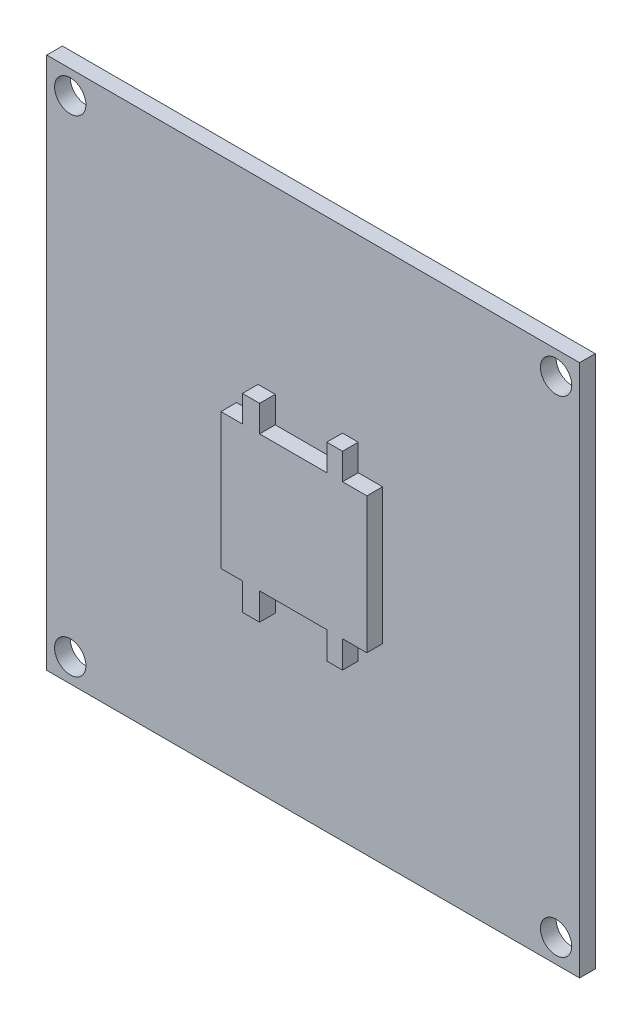
ISO-10303-21;
HEADER;
FILE_DESCRIPTION(('STEP AP214'),'2;1');
FILE_NAME('part.step','',(''),(''),'','','');
FILE_SCHEMA(('AUTOMOTIVE_DESIGN { 1 0 10303 214 1 1 1 1 }'));
ENDSEC;
DATA;
#1=APPLICATION_CONTEXT('core data for automotive mechanical design processes');
#2=APPLICATION_PROTOCOL_DEFINITION('international standard','automotive_design',2000,#1);
#3=PRODUCT_CONTEXT('',#1,'mechanical');
#4=PRODUCT('Part','Part','',(#3));
#5=PRODUCT_RELATED_PRODUCT_CATEGORY('part','',(#4));
#6=PRODUCT_DEFINITION_FORMATION('','',#4);
#7=PRODUCT_DEFINITION_CONTEXT('part definition',#1,'design');
#8=PRODUCT_DEFINITION('design','',#6,#7);
#9=PRODUCT_DEFINITION_SHAPE('','',#8);
#10=(LENGTH_UNIT() NAMED_UNIT(*) SI_UNIT(.MILLI.,.METRE.));
#11=(NAMED_UNIT(*) PLANE_ANGLE_UNIT() SI_UNIT($,.RADIAN.));
#12=(NAMED_UNIT(*) SI_UNIT($,.STERADIAN.) SOLID_ANGLE_UNIT());
#13=UNCERTAINTY_MEASURE_WITH_UNIT(LENGTH_MEASURE(1.E-05),#10,'distance_accuracy_value','');
#14=(GEOMETRIC_REPRESENTATION_CONTEXT(3) GLOBAL_UNCERTAINTY_ASSIGNED_CONTEXT((#13)) GLOBAL_UNIT_ASSIGNED_CONTEXT((#10,
#11,#12)) REPRESENTATION_CONTEXT('',''));
#15=CARTESIAN_POINT('',(0.,0.,0.));
#16=DIRECTION('',(0.,0.,1.));
#17=DIRECTION('',(1.,0.,0.));
#18=AXIS2_PLACEMENT_3D('',#15,#16,#17);
#19=CARTESIAN_POINT('',(0.,0.,1.));
#20=DIRECTION('',(0.,0.,-1.));
#21=DIRECTION('',(-1.,0.,0.));
#22=AXIS2_PLACEMENT_3D('',#19,#20,#21);
#23=PLANE('',#22);
#24=CARTESIAN_POINT('',(32.5,1.5,1.));
#25=DIRECTION('',(0.,0.,1.));
#26=DIRECTION('',(1.,0.,0.));
#27=AXIS2_PLACEMENT_3D('',#24,#25,#26);
#28=CIRCLE('',#27,0.999999999999998);
#29=CARTESIAN_POINT('',(33.5,1.5,1.));
#30=VERTEX_POINT('',#29);
#31=EDGE_CURVE('E237',#30,#30,#28,.T.);
#32=ORIENTED_EDGE('',*,*,#31,.F.);
#33=EDGE_LOOP('',(#32));
#34=FACE_BOUND('',#33,.T.);
#35=CARTESIAN_POINT('',(1.5,1.5,1.));
#36=DIRECTION('',(0.,0.,1.));
#37=DIRECTION('',(1.,0.,0.));
#38=AXIS2_PLACEMENT_3D('',#35,#36,#37);
#39=CIRCLE('',#38,1.);
#40=CARTESIAN_POINT('',(2.5,1.5,1.));
#41=VERTEX_POINT('',#40);
#42=EDGE_CURVE('E246',#41,#41,#39,.T.);
#43=ORIENTED_EDGE('',*,*,#42,.F.);
#44=EDGE_LOOP('',(#43));
#45=FACE_BOUND('',#44,.T.);
#46=CARTESIAN_POINT('',(32.5,32.5,1.));
#47=DIRECTION('',(0.,0.,1.));
#48=DIRECTION('',(1.,0.,0.));
#49=AXIS2_PLACEMENT_3D('',#46,#47,#48);
#50=CIRCLE('',#49,0.999999999999998);
#51=CARTESIAN_POINT('',(33.5,32.5,1.));
#52=VERTEX_POINT('',#51);
#53=EDGE_CURVE('E252',#52,#52,#50,.T.);
#54=ORIENTED_EDGE('',*,*,#53,.F.);
#55=EDGE_LOOP('',(#54));
#56=FACE_BOUND('',#55,.T.);
#57=CARTESIAN_POINT('',(1.5,32.5,1.));
#58=DIRECTION('',(0.,0.,1.));
#59=DIRECTION('',(1.,0.,0.));
#60=AXIS2_PLACEMENT_3D('',#57,#58,#59);
#61=CIRCLE('',#60,1.);
#62=CARTESIAN_POINT('',(2.5,32.5,1.));
#63=VERTEX_POINT('',#62);
#64=EDGE_CURVE('E258',#63,#63,#61,.T.);
#65=ORIENTED_EDGE('',*,*,#64,.F.);
#66=EDGE_LOOP('',(#65));
#67=FACE_BOUND('',#66,.T.);
#68=DIRECTION('',(0.,-1.,0.));
#69=VECTOR('',#68,1.);
#70=CARTESIAN_POINT('',(0.,0.,1.));
#71=LINE('',#70,#69);
#72=CARTESIAN_POINT('',(0.,34.,1.));
#73=VERTEX_POINT('',#72);
#74=CARTESIAN_POINT('',(0.,0.,1.));
#75=VERTEX_POINT('',#74);
#76=EDGE_CURVE('E264',#73,#75,#71,.T.);
#77=ORIENTED_EDGE('',*,*,#76,.T.);
#78=DIRECTION('',(1.,0.,0.));
#79=VECTOR('',#78,1.);
#80=CARTESIAN_POINT('',(0.,0.,1.));
#81=LINE('',#80,#79);
#82=CARTESIAN_POINT('',(34.,0.,1.));
#83=VERTEX_POINT('',#82);
#84=EDGE_CURVE('E88',#75,#83,#81,.T.);
#85=ORIENTED_EDGE('',*,*,#84,.T.);
#86=DIRECTION('',(0.,1.,0.));
#87=VECTOR('',#86,1.);
#88=CARTESIAN_POINT('',(34.,0.,1.));
#89=LINE('',#88,#87);
#90=CARTESIAN_POINT('',(34.,34.,1.));
#91=VERTEX_POINT('',#90);
#92=EDGE_CURVE('E267',#83,#91,#89,.T.);
#93=ORIENTED_EDGE('',*,*,#92,.T.);
#94=DIRECTION('',(-1.,0.,0.));
#95=VECTOR('',#94,1.);
#96=CARTESIAN_POINT('',(0.,34.,1.));
#97=LINE('',#96,#95);
#98=EDGE_CURVE('E60',#91,#73,#97,.T.);
#99=ORIENTED_EDGE('',*,*,#98,.T.);
#100=EDGE_LOOP('',(#77,#85,#93,#99));
#101=FACE_BOUND('',#100,.T.);
#102=DIRECTION('',(-1.,0.,0.));
#103=VECTOR('',#102,1.);
#104=CARTESIAN_POINT('',(0.,20.8566450376839,1.));
#105=LINE('',#104,#103);
#106=CARTESIAN_POINT('',(21.427154658643,20.8566450376839,1.));
#107=VERTEX_POINT('',#106);
#108=CARTESIAN_POINT('',(19.8753684896341,20.8566450376839,1.));
#109=VERTEX_POINT('',#108);
#110=EDGE_CURVE('E232',#107,#109,#105,.T.);
#111=ORIENTED_EDGE('',*,*,#110,.F.);
#112=DIRECTION('',(0.,-1.,0.));
#113=VECTOR('',#112,1.);
#114=CARTESIAN_POINT('',(21.427154658643,0.,1.));
#115=LINE('',#114,#113);
#116=CARTESIAN_POINT('',(21.427154658643,12.1848987991048,1.));
#117=VERTEX_POINT('',#116);
#118=EDGE_CURVE('E226',#107,#117,#115,.T.);
#119=ORIENTED_EDGE('',*,*,#118,.T.);
#120=DIRECTION('',(-1.,0.,0.));
#121=VECTOR('',#120,1.);
#122=CARTESIAN_POINT('',(0.,12.1848987991048,1.));
#123=LINE('',#122,#121);
#124=CARTESIAN_POINT('',(19.8753684896341,12.1848987991048,1.));
#125=VERTEX_POINT('',#124);
#126=EDGE_CURVE('E51',#117,#125,#123,.T.);
#127=ORIENTED_EDGE('',*,*,#126,.T.);
#128=DIRECTION('',(0.,-1.,0.));
#129=VECTOR('',#128,1.);
#130=CARTESIAN_POINT('',(19.8753684896341,0.,1.));
#131=LINE('',#130,#129);
#132=CARTESIAN_POINT('',(19.8753684896341,10.450549551389,1.));
#133=VERTEX_POINT('',#132);
#134=EDGE_CURVE('E684',#125,#133,#131,.T.);
#135=ORIENTED_EDGE('',*,*,#134,.T.);
#136=DIRECTION('',(1.,0.,0.));
#137=VECTOR('',#136,1.);
#138=CARTESIAN_POINT('',(0.,10.450549551389,1.));
#139=LINE('',#138,#137);
#140=CARTESIAN_POINT('',(18.871271556746,10.450549551389,1.));
#141=VERTEX_POINT('',#140);
#142=EDGE_CURVE('E681',#141,#133,#139,.T.);
#143=ORIENTED_EDGE('',*,*,#142,.F.);
#144=DIRECTION('',(0.,-1.,0.));
#145=VECTOR('',#144,1.);
#146=CARTESIAN_POINT('',(18.871271556746,0.,1.));
#147=LINE('',#146,#145);
#148=CARTESIAN_POINT('',(18.871271556746,12.1848987991048,1.));
#149=VERTEX_POINT('',#148);
#150=EDGE_CURVE('E679',#149,#141,#147,.T.);
#151=ORIENTED_EDGE('',*,*,#150,.F.);
#152=CARTESIAN_POINT('',(14.5810392071332,12.1848987991048,1.));
#153=VERTEX_POINT('',#152);
#154=EDGE_CURVE('E671',#149,#153,#123,.T.);
#155=ORIENTED_EDGE('',*,*,#154,.T.);
#156=DIRECTION('',(0.,-1.,0.));
#157=VECTOR('',#156,1.);
#158=CARTESIAN_POINT('',(14.5810392071332,0.,1.));
#159=LINE('',#158,#157);
#160=CARTESIAN_POINT('',(14.5810392071332,10.450549551389,1.));
#161=VERTEX_POINT('',#160);
#162=EDGE_CURVE('E676',#153,#161,#159,.T.);
#163=ORIENTED_EDGE('',*,*,#162,.T.);
#164=DIRECTION('',(1.,0.,0.));
#165=VECTOR('',#164,1.);
#166=CARTESIAN_POINT('',(0.,10.450549551389,1.));
#167=LINE('',#166,#165);
#168=CARTESIAN_POINT('',(13.4856607348916,10.450549551389,1.));
#169=VERTEX_POINT('',#168);
#170=EDGE_CURVE('E673',#169,#161,#167,.T.);
#171=ORIENTED_EDGE('',*,*,#170,.F.);
#172=DIRECTION('',(0.,-1.,0.));
#173=VECTOR('',#172,1.);
#174=CARTESIAN_POINT('',(13.4856607348916,0.,1.));
#175=LINE('',#174,#173);
#176=CARTESIAN_POINT('',(13.4856607348916,12.1848987991048,1.));
#177=VERTEX_POINT('',#176);
#178=EDGE_CURVE('E670',#177,#169,#175,.T.);
#179=ORIENTED_EDGE('',*,*,#178,.F.);
#180=CARTESIAN_POINT('',(12.1164376445897,12.1848987991048,1.));
#181=VERTEX_POINT('',#180);
#182=EDGE_CURVE('E667',#177,#181,#123,.T.);
#183=ORIENTED_EDGE('',*,*,#182,.T.);
#184=DIRECTION('',(0.,-1.,0.));
#185=VECTOR('',#184,1.);
#186=CARTESIAN_POINT('',(12.1164376445897,0.,1.));
#187=LINE('',#186,#185);
#188=CARTESIAN_POINT('',(12.1164376445897,20.8566450376839,1.));
#189=VERTEX_POINT('',#188);
#190=EDGE_CURVE('E664',#189,#181,#187,.T.);
#191=ORIENTED_EDGE('',*,*,#190,.F.);
#192=CARTESIAN_POINT('',(13.4856607348916,20.8566450376839,1.));
#193=VERTEX_POINT('',#192);
#194=EDGE_CURVE('E647',#193,#189,#105,.T.);
#195=ORIENTED_EDGE('',*,*,#194,.F.);
#196=DIRECTION('',(0.,1.,0.));
#197=VECTOR('',#196,1.);
#198=CARTESIAN_POINT('',(13.4856607348916,0.,1.));
#199=LINE('',#198,#197);
#200=CARTESIAN_POINT('',(13.4856607348916,22.5453535157229,1.));
#201=VERTEX_POINT('',#200);
#202=EDGE_CURVE('E658',#193,#201,#199,.T.);
#203=ORIENTED_EDGE('',*,*,#202,.T.);
#204=DIRECTION('',(1.,0.,0.));
#205=VECTOR('',#204,1.);
#206=CARTESIAN_POINT('',(0.,22.5453535157229,1.));
#207=LINE('',#206,#205);
#208=CARTESIAN_POINT('',(14.5810392071332,22.5453535157229,1.));
#209=VERTEX_POINT('',#208);
#210=EDGE_CURVE('E656',#201,#209,#207,.T.);
#211=ORIENTED_EDGE('',*,*,#210,.T.);
#212=DIRECTION('',(0.,1.,0.));
#213=VECTOR('',#212,1.);
#214=CARTESIAN_POINT('',(14.5810392071332,0.,1.));
#215=LINE('',#214,#213);
#216=CARTESIAN_POINT('',(14.5810392071332,20.8566450376839,1.));
#217=VERTEX_POINT('',#216);
#218=EDGE_CURVE('E644',#217,#209,#215,.T.);
#219=ORIENTED_EDGE('',*,*,#218,.F.);
#220=CARTESIAN_POINT('',(18.871271556746,20.8566450376839,1.));
#221=VERTEX_POINT('',#220);
#222=EDGE_CURVE('E634',#221,#217,#105,.T.);
#223=ORIENTED_EDGE('',*,*,#222,.F.);
#224=DIRECTION('',(0.,1.,0.));
#225=VECTOR('',#224,1.);
#226=CARTESIAN_POINT('',(18.871271556746,0.,1.));
#227=LINE('',#226,#225);
#228=CARTESIAN_POINT('',(18.871271556746,22.5453535157229,1.));
#229=VERTEX_POINT('',#228);
#230=EDGE_CURVE('E645',#221,#229,#227,.T.);
#231=ORIENTED_EDGE('',*,*,#230,.T.);
#232=DIRECTION('',(1.,0.,0.));
#233=VECTOR('',#232,1.);
#234=CARTESIAN_POINT('',(0.,22.5453535157229,1.));
#235=LINE('',#234,#233);
#236=CARTESIAN_POINT('',(19.8753684896341,22.5453535157229,1.));
#237=VERTEX_POINT('',#236);
#238=EDGE_CURVE('E726',#229,#237,#235,.T.);
#239=ORIENTED_EDGE('',*,*,#238,.T.);
#240=DIRECTION('',(0.,1.,0.));
#241=VECTOR('',#240,1.);
#242=CARTESIAN_POINT('',(19.8753684896341,0.,1.));
#243=LINE('',#242,#241);
#244=EDGE_CURVE('E727',#109,#237,#243,.T.);
#245=ORIENTED_EDGE('',*,*,#244,.F.);
#246=EDGE_LOOP('',(#111,#119,#127,#135,#143,#151,#155,#163,#171,#179,#183,#191,#195,#203,#211,
#219,#223,#231,#239,#245));
#247=FACE_BOUND('',#246,.T.);
#248=ADVANCED_FACE('F36',(#34,#45,#56,#67,#101,#247),#23,.F.);
#249=CARTESIAN_POINT('',(0.,0.,0.));
#250=DIRECTION('',(0.,0.,-1.));
#251=DIRECTION('',(-1.,0.,0.));
#252=AXIS2_PLACEMENT_3D('',#249,#250,#251);
#253=PLANE('',#252);
#254=CARTESIAN_POINT('',(1.5,1.5,0.));
#255=DIRECTION('',(0.,0.,1.));
#256=DIRECTION('',(1.,0.,0.));
#257=AXIS2_PLACEMENT_3D('',#254,#255,#256);
#258=CIRCLE('',#257,1.);
#259=CARTESIAN_POINT('',(2.5,1.5,0.));
#260=VERTEX_POINT('',#259);
#261=EDGE_CURVE('E244',#260,#260,#258,.T.);
#262=ORIENTED_EDGE('',*,*,#261,.T.);
#263=EDGE_LOOP('',(#262));
#264=FACE_BOUND('',#263,.T.);
#265=CARTESIAN_POINT('',(1.5,32.5,0.));
#266=DIRECTION('',(0.,0.,1.));
#267=DIRECTION('',(1.,0.,0.));
#268=AXIS2_PLACEMENT_3D('',#265,#266,#267);
#269=CIRCLE('',#268,1.);
#270=CARTESIAN_POINT('',(2.5,32.5,0.));
#271=VERTEX_POINT('',#270);
#272=EDGE_CURVE('E255',#271,#271,#269,.T.);
#273=ORIENTED_EDGE('',*,*,#272,.T.);
#274=EDGE_LOOP('',(#273));
#275=FACE_BOUND('',#274,.T.);
#276=DIRECTION('',(0.,-1.,0.));
#277=VECTOR('',#276,1.);
#278=CARTESIAN_POINT('',(0.,0.,0.));
#279=LINE('',#278,#277);
#280=CARTESIAN_POINT('',(0.,34.,0.));
#281=VERTEX_POINT('',#280);
#282=CARTESIAN_POINT('',(0.,0.,0.));
#283=VERTEX_POINT('',#282);
#284=EDGE_CURVE('E261',#281,#283,#279,.T.);
#285=ORIENTED_EDGE('',*,*,#284,.F.);
#286=DIRECTION('',(-1.,0.,0.));
#287=VECTOR('',#286,1.);
#288=CARTESIAN_POINT('',(0.,34.,0.));
#289=LINE('',#288,#287);
#290=CARTESIAN_POINT('',(34.,34.,0.));
#291=VERTEX_POINT('',#290);
#292=EDGE_CURVE('E81',#291,#281,#289,.T.);
#293=ORIENTED_EDGE('',*,*,#292,.F.);
#294=DIRECTION('',(0.,1.,0.));
#295=VECTOR('',#294,1.);
#296=CARTESIAN_POINT('',(34.,0.,0.));
#297=LINE('',#296,#295);
#298=CARTESIAN_POINT('',(34.,0.,0.));
#299=VERTEX_POINT('',#298);
#300=EDGE_CURVE('E275',#299,#291,#297,.T.);
#301=ORIENTED_EDGE('',*,*,#300,.F.);
#302=DIRECTION('',(1.,0.,0.));
#303=VECTOR('',#302,1.);
#304=CARTESIAN_POINT('',(0.,0.,0.));
#305=LINE('',#304,#303);
#306=EDGE_CURVE('E273',#283,#299,#305,.T.);
#307=ORIENTED_EDGE('',*,*,#306,.F.);
#308=EDGE_LOOP('',(#285,#293,#301,#307));
#309=FACE_BOUND('',#308,.T.);
#310=CARTESIAN_POINT('',(32.5,32.5,0.));
#311=DIRECTION('',(0.,0.,1.));
#312=DIRECTION('',(1.,0.,0.));
#313=AXIS2_PLACEMENT_3D('',#310,#311,#312);
#314=CIRCLE('',#313,0.999999999999998);
#315=CARTESIAN_POINT('',(33.5,32.5,0.));
#316=VERTEX_POINT('',#315);
#317=EDGE_CURVE('E249',#316,#316,#314,.T.);
#318=ORIENTED_EDGE('',*,*,#317,.T.);
#319=EDGE_LOOP('',(#318));
#320=FACE_BOUND('',#319,.T.);
#321=CARTESIAN_POINT('',(32.5,1.5,0.));
#322=DIRECTION('',(0.,0.,1.));
#323=DIRECTION('',(1.,0.,0.));
#324=AXIS2_PLACEMENT_3D('',#321,#322,#323);
#325=CIRCLE('',#324,0.999999999999998);
#326=CARTESIAN_POINT('',(33.5,1.5,0.));
#327=VERTEX_POINT('',#326);
#328=EDGE_CURVE('E234',#327,#327,#325,.T.);
#329=ORIENTED_EDGE('',*,*,#328,.T.);
#330=EDGE_LOOP('',(#329));
#331=FACE_BOUND('',#330,.T.);
#332=ADVANCED_FACE('F288',(#264,#275,#309,#320,#331),#253,.T.);
#333=CARTESIAN_POINT('',(0.,0.,1.));
#334=DIRECTION('',(1.,0.,0.));
#335=DIRECTION('',(0.,0.,-1.));
#336=AXIS2_PLACEMENT_3D('',#333,#334,#335);
#337=PLANE('',#336);
#338=ORIENTED_EDGE('',*,*,#284,.T.);
#339=DIRECTION('',(0.,0.,-1.));
#340=VECTOR('',#339,1.);
#341=CARTESIAN_POINT('',(0.,0.,1.));
#342=LINE('',#341,#340);
#343=EDGE_CURVE('E11',#75,#283,#342,.T.);
#344=ORIENTED_EDGE('',*,*,#343,.F.);
#345=ORIENTED_EDGE('',*,*,#76,.F.);
#346=DIRECTION('',(0.,0.,-1.));
#347=VECTOR('',#346,1.);
#348=CARTESIAN_POINT('',(0.,34.,1.));
#349=LINE('',#348,#347);
#350=EDGE_CURVE('E270',#73,#281,#349,.T.);
#351=ORIENTED_EDGE('',*,*,#350,.T.);
#352=EDGE_LOOP('',(#338,#344,#345,#351));
#353=FACE_BOUND('',#352,.T.);
#354=ADVANCED_FACE('F38',(#353),#337,.F.);
#355=CARTESIAN_POINT('',(0.,0.,1.));
#356=DIRECTION('',(0.,1.,0.));
#357=DIRECTION('',(0.,0.,1.));
#358=AXIS2_PLACEMENT_3D('',#355,#356,#357);
#359=PLANE('',#358);
#360=ORIENTED_EDGE('',*,*,#306,.T.);
#361=DIRECTION('',(0.,0.,-1.));
#362=VECTOR('',#361,1.);
#363=CARTESIAN_POINT('',(34.,0.,1.));
#364=LINE('',#363,#362);
#365=EDGE_CURVE('E44',#83,#299,#364,.T.);
#366=ORIENTED_EDGE('',*,*,#365,.F.);
#367=ORIENTED_EDGE('',*,*,#84,.F.);
#368=ORIENTED_EDGE('',*,*,#343,.T.);
#369=EDGE_LOOP('',(#360,#366,#367,#368));
#370=FACE_BOUND('',#369,.T.);
#371=ADVANCED_FACE('F304',(#370),#359,.F.);
#372=CARTESIAN_POINT('',(34.,0.,1.));
#373=DIRECTION('',(-1.,0.,0.));
#374=DIRECTION('',(0.,0.,1.));
#375=AXIS2_PLACEMENT_3D('',#372,#373,#374);
#376=PLANE('',#375);
#377=ORIENTED_EDGE('',*,*,#300,.T.);
#378=DIRECTION('',(0.,0.,-1.));
#379=VECTOR('',#378,1.);
#380=CARTESIAN_POINT('',(34.,34.,1.));
#381=LINE('',#380,#379);
#382=EDGE_CURVE('E279',#91,#291,#381,.T.);
#383=ORIENTED_EDGE('',*,*,#382,.F.);
#384=ORIENTED_EDGE('',*,*,#92,.F.);
#385=ORIENTED_EDGE('',*,*,#365,.T.);
#386=EDGE_LOOP('',(#377,#383,#384,#385));
#387=FACE_BOUND('',#386,.T.);
#388=ADVANCED_FACE('F284',(#387),#376,.F.);
#389=CARTESIAN_POINT('',(0.,34.,1.));
#390=DIRECTION('',(0.,-1.,0.));
#391=DIRECTION('',(0.,0.,-1.));
#392=AXIS2_PLACEMENT_3D('',#389,#390,#391);
#393=PLANE('',#392);
#394=ORIENTED_EDGE('',*,*,#292,.T.);
#395=ORIENTED_EDGE('',*,*,#350,.F.);
#396=ORIENTED_EDGE('',*,*,#98,.F.);
#397=ORIENTED_EDGE('',*,*,#382,.T.);
#398=EDGE_LOOP('',(#394,#395,#396,#397));
#399=FACE_BOUND('',#398,.T.);
#400=ADVANCED_FACE('F293',(#399),#393,.F.);
#401=CARTESIAN_POINT('',(1.5,32.5,1.));
#402=DIRECTION('',(0.,0.,-1.));
#403=DIRECTION('',(-1.,0.,0.));
#404=AXIS2_PLACEMENT_3D('',#401,#402,#403);
#405=CYLINDRICAL_SURFACE('',#404,1.);
#406=ORIENTED_EDGE('',*,*,#64,.T.);
#407=EDGE_LOOP('',(#406));
#408=FACE_BOUND('',#407,.T.);
#409=ORIENTED_EDGE('',*,*,#272,.F.);
#410=EDGE_LOOP('',(#409));
#411=FACE_BOUND('',#410,.T.);
#412=ADVANCED_FACE('F295',(#408,#411),#405,.F.);
#413=CARTESIAN_POINT('',(32.5,32.5,1.));
#414=DIRECTION('',(0.,0.,-1.));
#415=DIRECTION('',(-1.,0.,0.));
#416=AXIS2_PLACEMENT_3D('',#413,#414,#415);
#417=CYLINDRICAL_SURFACE('',#416,0.999999999999998);
#418=ORIENTED_EDGE('',*,*,#53,.T.);
#419=EDGE_LOOP('',(#418));
#420=FACE_BOUND('',#419,.T.);
#421=ORIENTED_EDGE('',*,*,#317,.F.);
#422=EDGE_LOOP('',(#421));
#423=FACE_BOUND('',#422,.T.);
#424=ADVANCED_FACE('F301',(#420,#423),#417,.F.);
#425=CARTESIAN_POINT('',(1.5,1.5,1.));
#426=DIRECTION('',(0.,0.,-1.));
#427=DIRECTION('',(-1.,0.,0.));
#428=AXIS2_PLACEMENT_3D('',#425,#426,#427);
#429=CYLINDRICAL_SURFACE('',#428,1.);
#430=ORIENTED_EDGE('',*,*,#42,.T.);
#431=EDGE_LOOP('',(#430));
#432=FACE_BOUND('',#431,.T.);
#433=ORIENTED_EDGE('',*,*,#261,.F.);
#434=EDGE_LOOP('',(#433));
#435=FACE_BOUND('',#434,.T.);
#436=ADVANCED_FACE('F319',(#432,#435),#429,.F.);
#437=CARTESIAN_POINT('',(32.5,1.5,1.));
#438=DIRECTION('',(0.,0.,-1.));
#439=DIRECTION('',(-1.,0.,0.));
#440=AXIS2_PLACEMENT_3D('',#437,#438,#439);
#441=CYLINDRICAL_SURFACE('',#440,0.999999999999998);
#442=ORIENTED_EDGE('',*,*,#31,.T.);
#443=EDGE_LOOP('',(#442));
#444=FACE_BOUND('',#443,.T.);
#445=ORIENTED_EDGE('',*,*,#328,.F.);
#446=EDGE_LOOP('',(#445));
#447=FACE_BOUND('',#446,.T.);
#448=ADVANCED_FACE('F323',(#444,#447),#441,.F.);
#449=CARTESIAN_POINT('',(0.,20.8566450376839,2.));
#450=DIRECTION('',(0.,-1.,0.));
#451=DIRECTION('',(0.,0.,-1.));
#452=AXIS2_PLACEMENT_3D('',#449,#450,#451);
#453=PLANE('',#452);
#454=ORIENTED_EDGE('',*,*,#110,.T.);
#455=DIRECTION('',(0.,0.,-1.));
#456=VECTOR('',#455,1.);
#457=CARTESIAN_POINT('',(19.8753684896341,20.8566450376839,2.));
#458=LINE('',#457,#456);
#459=CARTESIAN_POINT('',(19.8753684896341,20.8566450376839,2.));
#460=VERTEX_POINT('',#459);
#461=EDGE_CURVE('E210',#460,#109,#458,.T.);
#462=ORIENTED_EDGE('',*,*,#461,.F.);
#463=DIRECTION('',(-1.,0.,0.));
#464=VECTOR('',#463,1.);
#465=CARTESIAN_POINT('',(0.,20.8566450376839,2.));
#466=LINE('',#465,#464);
#467=CARTESIAN_POINT('',(21.427154658643,20.8566450376839,2.));
#468=VERTEX_POINT('',#467);
#469=EDGE_CURVE('E217',#468,#460,#466,.T.);
#470=ORIENTED_EDGE('',*,*,#469,.F.);
#471=DIRECTION('',(0.,0.,-1.));
#472=VECTOR('',#471,1.);
#473=CARTESIAN_POINT('',(21.427154658643,20.8566450376839,2.));
#474=LINE('',#473,#472);
#475=EDGE_CURVE('E689',#468,#107,#474,.T.);
#476=ORIENTED_EDGE('',*,*,#475,.T.);
#477=EDGE_LOOP('',(#454,#462,#470,#476));
#478=FACE_BOUND('',#477,.T.);
#479=ADVANCED_FACE('F230',(#478),#453,.F.);
#480=CARTESIAN_POINT('',(19.8753684896341,0.,2.));
#481=DIRECTION('',(-1.,0.,0.));
#482=DIRECTION('',(0.,0.,1.));
#483=AXIS2_PLACEMENT_3D('',#480,#481,#482);
#484=PLANE('',#483);
#485=ORIENTED_EDGE('',*,*,#244,.T.);
#486=DIRECTION('',(0.,0.,-1.));
#487=VECTOR('',#486,1.);
#488=CARTESIAN_POINT('',(19.8753684896341,22.5453535157229,2.));
#489=LINE('',#488,#487);
#490=CARTESIAN_POINT('',(19.8753684896341,22.5453535157229,2.));
#491=VERTEX_POINT('',#490);
#492=EDGE_CURVE('E212',#491,#237,#489,.T.);
#493=ORIENTED_EDGE('',*,*,#492,.F.);
#494=DIRECTION('',(0.,1.,0.));
#495=VECTOR('',#494,1.);
#496=CARTESIAN_POINT('',(19.8753684896341,0.,2.));
#497=LINE('',#496,#495);
#498=EDGE_CURVE('E205',#460,#491,#497,.T.);
#499=ORIENTED_EDGE('',*,*,#498,.F.);
#500=ORIENTED_EDGE('',*,*,#461,.T.);
#501=EDGE_LOOP('',(#485,#493,#499,#500));
#502=FACE_BOUND('',#501,.T.);
#503=ADVANCED_FACE('F208',(#502),#484,.F.);
#504=CARTESIAN_POINT('',(0.,22.5453535157229,2.));
#505=DIRECTION('',(0.,1.,0.));
#506=DIRECTION('',(0.,0.,1.));
#507=AXIS2_PLACEMENT_3D('',#504,#505,#506);
#508=PLANE('',#507);
#509=ORIENTED_EDGE('',*,*,#238,.F.);
#510=DIRECTION('',(0.,0.,-1.));
#511=VECTOR('',#510,1.);
#512=CARTESIAN_POINT('',(18.871271556746,22.5453535157229,2.));
#513=LINE('',#512,#511);
#514=CARTESIAN_POINT('',(18.871271556746,22.5453535157229,2.));
#515=VERTEX_POINT('',#514);
#516=EDGE_CURVE('E239',#515,#229,#513,.T.);
#517=ORIENTED_EDGE('',*,*,#516,.F.);
#518=DIRECTION('',(1.,0.,0.));
#519=VECTOR('',#518,1.);
#520=CARTESIAN_POINT('',(0.,22.5453535157229,2.));
#521=LINE('',#520,#519);
#522=EDGE_CURVE('E216',#515,#491,#521,.T.);
#523=ORIENTED_EDGE('',*,*,#522,.T.);
#524=ORIENTED_EDGE('',*,*,#492,.T.);
#525=EDGE_LOOP('',(#509,#517,#523,#524));
#526=FACE_BOUND('',#525,.T.);
#527=ADVANCED_FACE('F330',(#526),#508,.T.);
#528=CARTESIAN_POINT('',(18.871271556746,0.,2.));
#529=DIRECTION('',(-1.,0.,0.));
#530=DIRECTION('',(0.,0.,1.));
#531=AXIS2_PLACEMENT_3D('',#528,#529,#530);
#532=PLANE('',#531);
#533=ORIENTED_EDGE('',*,*,#230,.F.);
#534=DIRECTION('',(0.,0.,-1.));
#535=VECTOR('',#534,1.);
#536=CARTESIAN_POINT('',(18.871271556746,20.8566450376839,2.));
#537=LINE('',#536,#535);
#538=CARTESIAN_POINT('',(18.871271556746,20.8566450376839,2.));
#539=VERTEX_POINT('',#538);
#540=EDGE_CURVE('E639',#539,#221,#537,.T.);
#541=ORIENTED_EDGE('',*,*,#540,.F.);
#542=DIRECTION('',(0.,1.,0.));
#543=VECTOR('',#542,1.);
#544=CARTESIAN_POINT('',(18.871271556746,0.,2.));
#545=LINE('',#544,#543);
#546=EDGE_CURVE('E724',#539,#515,#545,.T.);
#547=ORIENTED_EDGE('',*,*,#546,.T.);
#548=ORIENTED_EDGE('',*,*,#516,.T.);
#549=EDGE_LOOP('',(#533,#541,#547,#548));
#550=FACE_BOUND('',#549,.T.);
#551=ADVANCED_FACE('F333',(#550),#532,.T.);
#552=ORIENTED_EDGE('',*,*,#222,.T.);
#553=DIRECTION('',(0.,0.,-1.));
#554=VECTOR('',#553,1.);
#555=CARTESIAN_POINT('',(14.5810392071332,20.8566450376839,2.));
#556=LINE('',#555,#554);
#557=CARTESIAN_POINT('',(14.5810392071332,20.8566450376839,2.));
#558=VERTEX_POINT('',#557);
#559=EDGE_CURVE('E637',#558,#217,#556,.T.);
#560=ORIENTED_EDGE('',*,*,#559,.F.);
#561=EDGE_CURVE('E229',#539,#558,#466,.T.);
#562=ORIENTED_EDGE('',*,*,#561,.F.);
#563=ORIENTED_EDGE('',*,*,#540,.T.);
#564=EDGE_LOOP('',(#552,#560,#562,#563));
#565=FACE_BOUND('',#564,.T.);
#566=ADVANCED_FACE('F337',(#565),#453,.F.);
#567=CARTESIAN_POINT('',(14.5810392071332,0.,2.));
#568=DIRECTION('',(-1.,0.,0.));
#569=DIRECTION('',(0.,0.,1.));
#570=AXIS2_PLACEMENT_3D('',#567,#568,#569);
#571=PLANE('',#570);
#572=ORIENTED_EDGE('',*,*,#218,.T.);
#573=DIRECTION('',(0.,0.,-1.));
#574=VECTOR('',#573,1.);
#575=CARTESIAN_POINT('',(14.5810392071332,22.5453535157229,2.));
#576=LINE('',#575,#574);
#577=CARTESIAN_POINT('',(14.5810392071332,22.5453535157229,2.));
#578=VERTEX_POINT('',#577);
#579=EDGE_CURVE('E652',#578,#209,#576,.T.);
#580=ORIENTED_EDGE('',*,*,#579,.F.);
#581=DIRECTION('',(0.,1.,0.));
#582=VECTOR('',#581,1.);
#583=CARTESIAN_POINT('',(14.5810392071332,0.,2.));
#584=LINE('',#583,#582);
#585=EDGE_CURVE('E651',#558,#578,#584,.T.);
#586=ORIENTED_EDGE('',*,*,#585,.F.);
#587=ORIENTED_EDGE('',*,*,#559,.T.);
#588=EDGE_LOOP('',(#572,#580,#586,#587));
#589=FACE_BOUND('',#588,.T.);
#590=ADVANCED_FACE('F339',(#589),#571,.F.);
#591=CARTESIAN_POINT('',(0.,22.5453535157229,2.));
#592=DIRECTION('',(0.,1.,0.));
#593=DIRECTION('',(0.,0.,1.));
#594=AXIS2_PLACEMENT_3D('',#591,#592,#593);
#595=PLANE('',#594);
#596=ORIENTED_EDGE('',*,*,#210,.F.);
#597=DIRECTION('',(0.,0.,-1.));
#598=VECTOR('',#597,1.);
#599=CARTESIAN_POINT('',(13.4856607348916,22.5453535157229,2.));
#600=LINE('',#599,#598);
#601=CARTESIAN_POINT('',(13.4856607348916,22.5453535157229,2.));
#602=VERTEX_POINT('',#601);
#603=EDGE_CURVE('E718',#602,#201,#600,.T.);
#604=ORIENTED_EDGE('',*,*,#603,.F.);
#605=DIRECTION('',(1.,0.,0.));
#606=VECTOR('',#605,1.);
#607=CARTESIAN_POINT('',(0.,22.5453535157229,2.));
#608=LINE('',#607,#606);
#609=EDGE_CURVE('E755',#602,#578,#608,.T.);
#610=ORIENTED_EDGE('',*,*,#609,.T.);
#611=ORIENTED_EDGE('',*,*,#579,.T.);
#612=EDGE_LOOP('',(#596,#604,#610,#611));
#613=FACE_BOUND('',#612,.T.);
#614=ADVANCED_FACE('F342',(#613),#595,.T.);
#615=CARTESIAN_POINT('',(13.4856607348916,0.,2.));
#616=DIRECTION('',(-1.,0.,0.));
#617=DIRECTION('',(0.,0.,1.));
#618=AXIS2_PLACEMENT_3D('',#615,#616,#617);
#619=PLANE('',#618);
#620=ORIENTED_EDGE('',*,*,#202,.F.);
#621=DIRECTION('',(0.,0.,-1.));
#622=VECTOR('',#621,1.);
#623=CARTESIAN_POINT('',(13.4856607348916,20.8566450376839,2.));
#624=LINE('',#623,#622);
#625=CARTESIAN_POINT('',(13.4856607348916,20.8566450376839,2.));
#626=VERTEX_POINT('',#625);
#627=EDGE_CURVE('E716',#626,#193,#624,.T.);
#628=ORIENTED_EDGE('',*,*,#627,.F.);
#629=DIRECTION('',(0.,1.,0.));
#630=VECTOR('',#629,1.);
#631=CARTESIAN_POINT('',(13.4856607348916,0.,2.));
#632=LINE('',#631,#630);
#633=EDGE_CURVE('E752',#626,#602,#632,.T.);
#634=ORIENTED_EDGE('',*,*,#633,.T.);
#635=ORIENTED_EDGE('',*,*,#603,.T.);
#636=EDGE_LOOP('',(#620,#628,#634,#635));
#637=FACE_BOUND('',#636,.T.);
#638=ADVANCED_FACE('F346',(#637),#619,.T.);
#639=ORIENTED_EDGE('',*,*,#194,.T.);
#640=DIRECTION('',(0.,0.,-1.));
#641=VECTOR('',#640,1.);
#642=CARTESIAN_POINT('',(12.1164376445897,20.8566450376839,2.));
#643=LINE('',#642,#641);
#644=CARTESIAN_POINT('',(12.1164376445897,20.8566450376839,2.));
#645=VERTEX_POINT('',#644);
#646=EDGE_CURVE('E713',#645,#189,#643,.T.);
#647=ORIENTED_EDGE('',*,*,#646,.F.);
#648=EDGE_CURVE('E228',#626,#645,#466,.T.);
#649=ORIENTED_EDGE('',*,*,#648,.F.);
#650=ORIENTED_EDGE('',*,*,#627,.T.);
#651=EDGE_LOOP('',(#639,#647,#649,#650));
#652=FACE_BOUND('',#651,.T.);
#653=ADVANCED_FACE('F350',(#652),#453,.F.);
#654=CARTESIAN_POINT('',(12.1164376445897,0.,2.));
#655=DIRECTION('',(1.,0.,0.));
#656=DIRECTION('',(0.,0.,-1.));
#657=AXIS2_PLACEMENT_3D('',#654,#655,#656);
#658=PLANE('',#657);
#659=ORIENTED_EDGE('',*,*,#190,.T.);
#660=DIRECTION('',(0.,0.,-1.));
#661=VECTOR('',#660,1.);
#662=CARTESIAN_POINT('',(12.1164376445897,12.1848987991048,2.));
#663=LINE('',#662,#661);
#664=CARTESIAN_POINT('',(12.1164376445897,12.1848987991048,2.));
#665=VERTEX_POINT('',#664);
#666=EDGE_CURVE('E711',#665,#181,#663,.T.);
#667=ORIENTED_EDGE('',*,*,#666,.F.);
#668=DIRECTION('',(0.,-1.,0.));
#669=VECTOR('',#668,1.);
#670=CARTESIAN_POINT('',(12.1164376445897,0.,2.));
#671=LINE('',#670,#669);
#672=EDGE_CURVE('E750',#645,#665,#671,.T.);
#673=ORIENTED_EDGE('',*,*,#672,.F.);
#674=ORIENTED_EDGE('',*,*,#646,.T.);
#675=EDGE_LOOP('',(#659,#667,#673,#674));
#676=FACE_BOUND('',#675,.T.);
#677=ADVANCED_FACE('F354',(#676),#658,.F.);
#678=CARTESIAN_POINT('',(0.,12.1848987991048,2.));
#679=DIRECTION('',(0.,-1.,0.));
#680=DIRECTION('',(0.,0.,-1.));
#681=AXIS2_PLACEMENT_3D('',#678,#679,#680);
#682=PLANE('',#681);
#683=ORIENTED_EDGE('',*,*,#182,.F.);
#684=DIRECTION('',(0.,0.,-1.));
#685=VECTOR('',#684,1.);
#686=CARTESIAN_POINT('',(13.4856607348916,12.1848987991048,2.));
#687=LINE('',#686,#685);
#688=CARTESIAN_POINT('',(13.4856607348916,12.1848987991048,2.));
#689=VERTEX_POINT('',#688);
#690=EDGE_CURVE('E709',#689,#177,#687,.T.);
#691=ORIENTED_EDGE('',*,*,#690,.F.);
#692=DIRECTION('',(-1.,0.,0.));
#693=VECTOR('',#692,1.);
#694=CARTESIAN_POINT('',(0.,12.1848987991048,2.));
#695=LINE('',#694,#693);
#696=EDGE_CURVE('E747',#689,#665,#695,.T.);
#697=ORIENTED_EDGE('',*,*,#696,.T.);
#698=ORIENTED_EDGE('',*,*,#666,.T.);
#699=EDGE_LOOP('',(#683,#691,#697,#698));
#700=FACE_BOUND('',#699,.T.);
#701=ADVANCED_FACE('F358',(#700),#682,.T.);
#702=CARTESIAN_POINT('',(13.4856607348916,0.,2.));
#703=DIRECTION('',(1.,0.,0.));
#704=DIRECTION('',(0.,0.,-1.));
#705=AXIS2_PLACEMENT_3D('',#702,#703,#704);
#706=PLANE('',#705);
#707=ORIENTED_EDGE('',*,*,#178,.T.);
#708=DIRECTION('',(0.,0.,-1.));
#709=VECTOR('',#708,1.);
#710=CARTESIAN_POINT('',(13.4856607348916,10.450549551389,2.));
#711=LINE('',#710,#709);
#712=CARTESIAN_POINT('',(13.4856607348916,10.450549551389,2.));
#713=VERTEX_POINT('',#712);
#714=EDGE_CURVE('E706',#713,#169,#711,.T.);
#715=ORIENTED_EDGE('',*,*,#714,.F.);
#716=DIRECTION('',(0.,-1.,0.));
#717=VECTOR('',#716,1.);
#718=CARTESIAN_POINT('',(13.4856607348916,0.,2.));
#719=LINE('',#718,#717);
#720=EDGE_CURVE('E745',#689,#713,#719,.T.);
#721=ORIENTED_EDGE('',*,*,#720,.F.);
#722=ORIENTED_EDGE('',*,*,#690,.T.);
#723=EDGE_LOOP('',(#707,#715,#721,#722));
#724=FACE_BOUND('',#723,.T.);
#725=ADVANCED_FACE('F360',(#724),#706,.F.);
#726=CARTESIAN_POINT('',(0.,10.450549551389,2.));
#727=DIRECTION('',(0.,1.,0.));
#728=DIRECTION('',(0.,0.,1.));
#729=AXIS2_PLACEMENT_3D('',#726,#727,#728);
#730=PLANE('',#729);
#731=ORIENTED_EDGE('',*,*,#170,.T.);
#732=DIRECTION('',(0.,0.,-1.));
#733=VECTOR('',#732,1.);
#734=CARTESIAN_POINT('',(14.5810392071332,10.450549551389,2.));
#735=LINE('',#734,#733);
#736=CARTESIAN_POINT('',(14.5810392071332,10.450549551389,2.));
#737=VERTEX_POINT('',#736);
#738=EDGE_CURVE('E704',#737,#161,#735,.T.);
#739=ORIENTED_EDGE('',*,*,#738,.F.);
#740=DIRECTION('',(1.,0.,0.));
#741=VECTOR('',#740,1.);
#742=CARTESIAN_POINT('',(0.,10.450549551389,2.));
#743=LINE('',#742,#741);
#744=EDGE_CURVE('E743',#713,#737,#743,.T.);
#745=ORIENTED_EDGE('',*,*,#744,.F.);
#746=ORIENTED_EDGE('',*,*,#714,.T.);
#747=EDGE_LOOP('',(#731,#739,#745,#746));
#748=FACE_BOUND('',#747,.T.);
#749=ADVANCED_FACE('F363',(#748),#730,.F.);
#750=CARTESIAN_POINT('',(14.5810392071332,0.,2.));
#751=DIRECTION('',(1.,0.,0.));
#752=DIRECTION('',(0.,0.,-1.));
#753=AXIS2_PLACEMENT_3D('',#750,#751,#752);
#754=PLANE('',#753);
#755=ORIENTED_EDGE('',*,*,#162,.F.);
#756=DIRECTION('',(0.,0.,-1.));
#757=VECTOR('',#756,1.);
#758=CARTESIAN_POINT('',(14.5810392071332,12.1848987991048,2.));
#759=LINE('',#758,#757);
#760=CARTESIAN_POINT('',(14.5810392071332,12.1848987991048,2.));
#761=VERTEX_POINT('',#760);
#762=EDGE_CURVE('E702',#761,#153,#759,.T.);
#763=ORIENTED_EDGE('',*,*,#762,.F.);
#764=DIRECTION('',(0.,-1.,0.));
#765=VECTOR('',#764,1.);
#766=CARTESIAN_POINT('',(14.5810392071332,0.,2.));
#767=LINE('',#766,#765);
#768=EDGE_CURVE('E740',#761,#737,#767,.T.);
#769=ORIENTED_EDGE('',*,*,#768,.T.);
#770=ORIENTED_EDGE('',*,*,#738,.T.);
#771=EDGE_LOOP('',(#755,#763,#769,#770));
#772=FACE_BOUND('',#771,.T.);
#773=ADVANCED_FACE('F367',(#772),#754,.T.);
#774=ORIENTED_EDGE('',*,*,#154,.F.);
#775=DIRECTION('',(0.,0.,-1.));
#776=VECTOR('',#775,1.);
#777=CARTESIAN_POINT('',(18.871271556746,12.1848987991048,2.));
#778=LINE('',#777,#776);
#779=CARTESIAN_POINT('',(18.871271556746,12.1848987991048,2.));
#780=VERTEX_POINT('',#779);
#781=EDGE_CURVE('E700',#780,#149,#778,.T.);
#782=ORIENTED_EDGE('',*,*,#781,.F.);
#783=EDGE_CURVE('E739',#780,#761,#695,.T.);
#784=ORIENTED_EDGE('',*,*,#783,.T.);
#785=ORIENTED_EDGE('',*,*,#762,.T.);
#786=EDGE_LOOP('',(#774,#782,#784,#785));
#787=FACE_BOUND('',#786,.T.);
#788=ADVANCED_FACE('F371',(#787),#682,.T.);
#789=CARTESIAN_POINT('',(18.871271556746,0.,2.));
#790=DIRECTION('',(1.,0.,0.));
#791=DIRECTION('',(0.,0.,-1.));
#792=AXIS2_PLACEMENT_3D('',#789,#790,#791);
#793=PLANE('',#792);
#794=ORIENTED_EDGE('',*,*,#150,.T.);
#795=DIRECTION('',(0.,0.,-1.));
#796=VECTOR('',#795,1.);
#797=CARTESIAN_POINT('',(18.871271556746,10.450549551389,2.));
#798=LINE('',#797,#796);
#799=CARTESIAN_POINT('',(18.871271556746,10.450549551389,2.));
#800=VERTEX_POINT('',#799);
#801=EDGE_CURVE('E697',#800,#141,#798,.T.);
#802=ORIENTED_EDGE('',*,*,#801,.F.);
#803=DIRECTION('',(0.,-1.,0.));
#804=VECTOR('',#803,1.);
#805=CARTESIAN_POINT('',(18.871271556746,0.,2.));
#806=LINE('',#805,#804);
#807=EDGE_CURVE('E737',#780,#800,#806,.T.);
#808=ORIENTED_EDGE('',*,*,#807,.F.);
#809=ORIENTED_EDGE('',*,*,#781,.T.);
#810=EDGE_LOOP('',(#794,#802,#808,#809));
#811=FACE_BOUND('',#810,.T.);
#812=ADVANCED_FACE('F373',(#811),#793,.F.);
#813=CARTESIAN_POINT('',(0.,10.450549551389,2.));
#814=DIRECTION('',(0.,1.,0.));
#815=DIRECTION('',(0.,0.,1.));
#816=AXIS2_PLACEMENT_3D('',#813,#814,#815);
#817=PLANE('',#816);
#818=ORIENTED_EDGE('',*,*,#142,.T.);
#819=DIRECTION('',(0.,0.,-1.));
#820=VECTOR('',#819,1.);
#821=CARTESIAN_POINT('',(19.8753684896341,10.450549551389,2.));
#822=LINE('',#821,#820);
#823=CARTESIAN_POINT('',(19.8753684896341,10.450549551389,2.));
#824=VERTEX_POINT('',#823);
#825=EDGE_CURVE('E695',#824,#133,#822,.T.);
#826=ORIENTED_EDGE('',*,*,#825,.F.);
#827=DIRECTION('',(1.,0.,0.));
#828=VECTOR('',#827,1.);
#829=CARTESIAN_POINT('',(0.,10.450549551389,2.));
#830=LINE('',#829,#828);
#831=EDGE_CURVE('E735',#800,#824,#830,.T.);
#832=ORIENTED_EDGE('',*,*,#831,.F.);
#833=ORIENTED_EDGE('',*,*,#801,.T.);
#834=EDGE_LOOP('',(#818,#826,#832,#833));
#835=FACE_BOUND('',#834,.T.);
#836=ADVANCED_FACE('F376',(#835),#817,.F.);
#837=CARTESIAN_POINT('',(19.8753684896341,0.,2.));
#838=DIRECTION('',(1.,0.,0.));
#839=DIRECTION('',(0.,0.,-1.));
#840=AXIS2_PLACEMENT_3D('',#837,#838,#839);
#841=PLANE('',#840);
#842=ORIENTED_EDGE('',*,*,#134,.F.);
#843=DIRECTION('',(0.,0.,-1.));
#844=VECTOR('',#843,1.);
#845=CARTESIAN_POINT('',(19.8753684896341,12.1848987991048,2.));
#846=LINE('',#845,#844);
#847=CARTESIAN_POINT('',(19.8753684896341,12.1848987991048,2.));
#848=VERTEX_POINT('',#847);
#849=EDGE_CURVE('E693',#848,#125,#846,.T.);
#850=ORIENTED_EDGE('',*,*,#849,.F.);
#851=DIRECTION('',(0.,-1.,0.));
#852=VECTOR('',#851,1.);
#853=CARTESIAN_POINT('',(19.8753684896341,0.,2.));
#854=LINE('',#853,#852);
#855=EDGE_CURVE('E732',#848,#824,#854,.T.);
#856=ORIENTED_EDGE('',*,*,#855,.T.);
#857=ORIENTED_EDGE('',*,*,#825,.T.);
#858=EDGE_LOOP('',(#842,#850,#856,#857));
#859=FACE_BOUND('',#858,.T.);
#860=ADVANCED_FACE('F380',(#859),#841,.T.);
#861=ORIENTED_EDGE('',*,*,#126,.F.);
#862=DIRECTION('',(0.,0.,-1.));
#863=VECTOR('',#862,1.);
#864=CARTESIAN_POINT('',(21.427154658643,12.1848987991048,2.));
#865=LINE('',#864,#863);
#866=CARTESIAN_POINT('',(21.427154658643,12.1848987991048,2.));
#867=VERTEX_POINT('',#866);
#868=EDGE_CURVE('E691',#867,#117,#865,.T.);
#869=ORIENTED_EDGE('',*,*,#868,.F.);
#870=EDGE_CURVE('E731',#867,#848,#695,.T.);
#871=ORIENTED_EDGE('',*,*,#870,.T.);
#872=ORIENTED_EDGE('',*,*,#849,.T.);
#873=EDGE_LOOP('',(#861,#869,#871,#872));
#874=FACE_BOUND('',#873,.T.);
#875=ADVANCED_FACE('F384',(#874),#682,.T.);
#876=CARTESIAN_POINT('',(21.427154658643,0.,2.));
#877=DIRECTION('',(1.,0.,0.));
#878=DIRECTION('',(0.,0.,-1.));
#879=AXIS2_PLACEMENT_3D('',#876,#877,#878);
#880=PLANE('',#879);
#881=ORIENTED_EDGE('',*,*,#118,.F.);
#882=ORIENTED_EDGE('',*,*,#475,.F.);
#883=DIRECTION('',(0.,-1.,0.));
#884=VECTOR('',#883,1.);
#885=CARTESIAN_POINT('',(21.427154658643,0.,2.));
#886=LINE('',#885,#884);
#887=EDGE_CURVE('E224',#468,#867,#886,.T.);
#888=ORIENTED_EDGE('',*,*,#887,.T.);
#889=ORIENTED_EDGE('',*,*,#868,.T.);
#890=EDGE_LOOP('',(#881,#882,#888,#889));
#891=FACE_BOUND('',#890,.T.);
#892=ADVANCED_FACE('F388',(#891),#880,.T.);
#893=CARTESIAN_POINT('',(0.,0.,2.));
#894=DIRECTION('',(0.,0.,1.));
#895=DIRECTION('',(1.,0.,0.));
#896=AXIS2_PLACEMENT_3D('',#893,#894,#895);
#897=PLANE('',#896);
#898=ORIENTED_EDGE('',*,*,#469,.T.);
#899=ORIENTED_EDGE('',*,*,#498,.T.);
#900=ORIENTED_EDGE('',*,*,#522,.F.);
#901=ORIENTED_EDGE('',*,*,#546,.F.);
#902=ORIENTED_EDGE('',*,*,#561,.T.);
#903=ORIENTED_EDGE('',*,*,#585,.T.);
#904=ORIENTED_EDGE('',*,*,#609,.F.);
#905=ORIENTED_EDGE('',*,*,#633,.F.);
#906=ORIENTED_EDGE('',*,*,#648,.T.);
#907=ORIENTED_EDGE('',*,*,#672,.T.);
#908=ORIENTED_EDGE('',*,*,#696,.F.);
#909=ORIENTED_EDGE('',*,*,#720,.T.);
#910=ORIENTED_EDGE('',*,*,#744,.T.);
#911=ORIENTED_EDGE('',*,*,#768,.F.);
#912=ORIENTED_EDGE('',*,*,#783,.F.);
#913=ORIENTED_EDGE('',*,*,#807,.T.);
#914=ORIENTED_EDGE('',*,*,#831,.T.);
#915=ORIENTED_EDGE('',*,*,#855,.F.);
#916=ORIENTED_EDGE('',*,*,#870,.F.);
#917=ORIENTED_EDGE('',*,*,#887,.F.);
#918=EDGE_LOOP('',(#898,#899,#900,#901,#902,#903,#904,#905,#906,#907,#908,#909,#910,#911,#912,
#913,#914,#915,#916,#917));
#919=FACE_BOUND('',#918,.T.);
#920=ADVANCED_FACE('F221',(#919),#897,.T.);
#921=CLOSED_SHELL('',(#248,#332,#354,#371,#388,#400,#412,#424,#436,#448,#479,#503,#527,#551,
#566,#590,#614,#638,#653,#677,#701,#725,#749,#773,#788,#812,#836,#860,#875,#892,#920));
#922=MANIFOLD_SOLID_BREP('B2',#921);
#923=ADVANCED_BREP_SHAPE_REPRESENTATION('',(#18,#922),#14);
#924=SHAPE_DEFINITION_REPRESENTATION(#9,#923);
ENDSEC;
END-ISO-10303-21;
